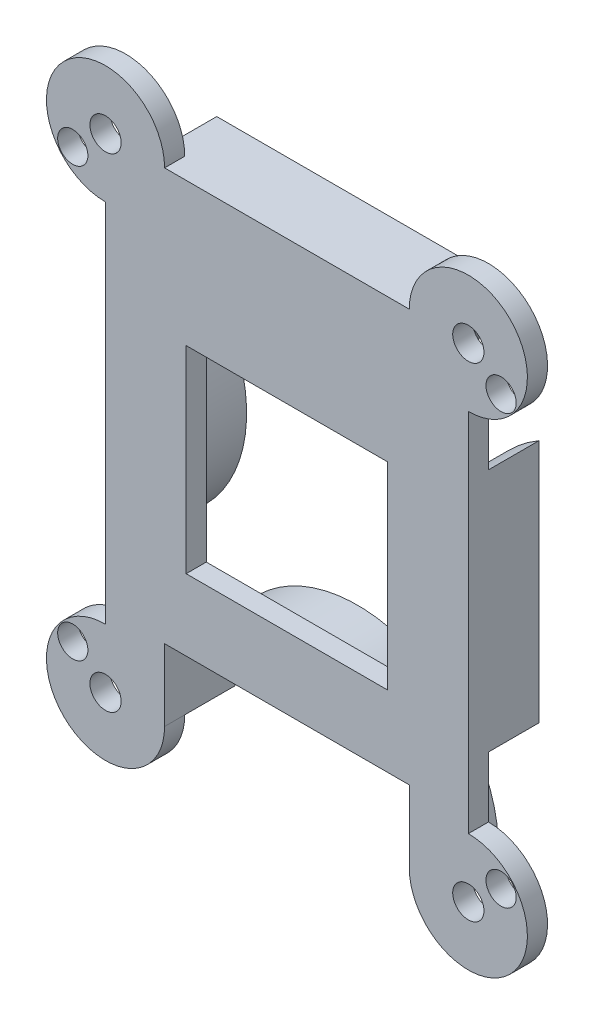
ISO-10303-21;
HEADER;
FILE_DESCRIPTION(('STEP AP214'),'2;1');
FILE_NAME('part.step','',(''),(''),'','','');
FILE_SCHEMA(('AUTOMOTIVE_DESIGN { 1 0 10303 214 1 1 1 1 }'));
ENDSEC;
DATA;
#1=APPLICATION_CONTEXT('core data for automotive mechanical design processes');
#2=APPLICATION_PROTOCOL_DEFINITION('international standard','automotive_design',2000,#1);
#3=PRODUCT_CONTEXT('',#1,'mechanical');
#4=PRODUCT('Part','Part','',(#3));
#5=PRODUCT_RELATED_PRODUCT_CATEGORY('part','',(#4));
#6=PRODUCT_DEFINITION_FORMATION('','',#4);
#7=PRODUCT_DEFINITION_CONTEXT('part definition',#1,'design');
#8=PRODUCT_DEFINITION('design','',#6,#7);
#9=PRODUCT_DEFINITION_SHAPE('','',#8);
#10=(LENGTH_UNIT() NAMED_UNIT(*) SI_UNIT(.MILLI.,.METRE.));
#11=(NAMED_UNIT(*) PLANE_ANGLE_UNIT() SI_UNIT($,.RADIAN.));
#12=(NAMED_UNIT(*) SI_UNIT($,.STERADIAN.) SOLID_ANGLE_UNIT());
#13=UNCERTAINTY_MEASURE_WITH_UNIT(LENGTH_MEASURE(1.E-05),#10,'distance_accuracy_value','');
#14=(GEOMETRIC_REPRESENTATION_CONTEXT(3) GLOBAL_UNCERTAINTY_ASSIGNED_CONTEXT((#13)) GLOBAL_UNIT_ASSIGNED_CONTEXT((#10,
#11,#12)) REPRESENTATION_CONTEXT('',''));
#15=CARTESIAN_POINT('',(0.,0.,0.));
#16=DIRECTION('',(0.,0.,1.));
#17=DIRECTION('',(1.,0.,0.));
#18=AXIS2_PLACEMENT_3D('',#15,#16,#17);
#19=CARTESIAN_POINT('',(0.,-24.,2.));
#20=DIRECTION('',(0.,1.,0.));
#21=DIRECTION('',(0.,0.,1.));
#22=AXIS2_PLACEMENT_3D('',#19,#20,#21);
#23=PLANE('',#22);
#24=DIRECTION('',(1.,0.,0.));
#25=VECTOR('',#24,1.);
#26=CARTESIAN_POINT('',(0.,-24.,-5.));
#27=LINE('',#26,#25);
#28=CARTESIAN_POINT('',(-13.9642400437689,-24.,-5.));
#29=VERTEX_POINT('',#28);
#30=CARTESIAN_POINT('',(-12.1394203950022,-24.,-5.));
#31=VERTEX_POINT('',#30);
#32=EDGE_CURVE('E369',#29,#31,#27,.T.);
#33=ORIENTED_EDGE('',*,*,#32,.T.);
#34=DIRECTION('',(0.,0.,1.));
#35=VECTOR('',#34,1.);
#36=CARTESIAN_POINT('',(-12.1394203950022,-24.,2.));
#37=LINE('',#36,#35);
#38=CARTESIAN_POINT('',(-12.1394203950022,-24.,0.));
#39=VERTEX_POINT('',#38);
#40=EDGE_CURVE('E310',#31,#39,#37,.T.);
#41=ORIENTED_EDGE('',*,*,#40,.T.);
#42=DIRECTION('',(1.,0.,0.));
#43=VECTOR('',#42,1.);
#44=CARTESIAN_POINT('',(0.,-24.,0.));
#45=LINE('',#44,#43);
#46=CARTESIAN_POINT('',(-13.9642400437689,-24.,0.));
#47=VERTEX_POINT('',#46);
#48=EDGE_CURVE('E378',#47,#39,#45,.T.);
#49=ORIENTED_EDGE('',*,*,#48,.F.);
#50=DIRECTION('',(0.,0.,1.));
#51=VECTOR('',#50,1.);
#52=CARTESIAN_POINT('',(-13.9642400437689,-24.,-5.));
#53=LINE('',#52,#51);
#54=EDGE_CURVE('E372',#29,#47,#53,.T.);
#55=ORIENTED_EDGE('',*,*,#54,.F.);
#56=EDGE_LOOP('',(#33,#41,#49,#55));
#57=FACE_BOUND('',#56,.T.);
#58=ADVANCED_FACE('F85',(#57),#23,.F.);
#59=CARTESIAN_POINT('',(0.,-25.,-5.));
#60=DIRECTION('',(0.,0.,1.));
#61=DIRECTION('',(1.,0.,0.));
#62=AXIS2_PLACEMENT_3D('',#59,#60,#61);
#63=CYLINDRICAL_SURFACE('',#62,14.);
#64=CARTESIAN_POINT('',(0.,-25.,0.));
#65=DIRECTION('',(0.,0.,1.));
#66=DIRECTION('',(1.,0.,0.));
#67=AXIS2_PLACEMENT_3D('',#64,#65,#66);
#68=CIRCLE('',#67,14.);
#69=CARTESIAN_POINT('',(-12.1394203950022,-18.0261579833348,0.));
#70=VERTEX_POINT('',#69);
#71=EDGE_CURVE('E373',#47,#70,#68,.F.);
#72=ORIENTED_EDGE('',*,*,#71,.T.);
#73=DIRECTION('',(0.,0.,1.));
#74=VECTOR('',#73,1.);
#75=CARTESIAN_POINT('',(-12.1394203950022,-18.0261579833348,-5.));
#76=LINE('',#75,#74);
#77=CARTESIAN_POINT('',(-12.1394203950022,-18.0261579833348,-5.));
#78=VERTEX_POINT('',#77);
#79=EDGE_CURVE('E307',#70,#78,#76,.F.);
#80=ORIENTED_EDGE('',*,*,#79,.T.);
#81=CARTESIAN_POINT('',(0.,-25.,-5.));
#82=DIRECTION('',(0.,0.,1.));
#83=DIRECTION('',(1.,0.,0.));
#84=AXIS2_PLACEMENT_3D('',#81,#82,#83);
#85=CIRCLE('',#84,14.);
#86=EDGE_CURVE('E363',#29,#78,#85,.F.);
#87=ORIENTED_EDGE('',*,*,#86,.F.);
#88=ORIENTED_EDGE('',*,*,#54,.T.);
#89=EDGE_LOOP('',(#72,#80,#87,#88));
#90=FACE_BOUND('',#89,.T.);
#91=ADVANCED_FACE('F579',(#90),#63,.T.);
#92=CARTESIAN_POINT('',(-11.405462124256,-16.8811679576332,-5.));
#93=VERTEX_POINT('',#92);
#94=CARTESIAN_POINT('',(11.405462124256,-16.8811679576332,-5.));
#95=VERTEX_POINT('',#94);
#96=EDGE_CURVE('E367',#93,#95,#85,.F.);
#97=ORIENTED_EDGE('',*,*,#96,.F.);
#98=DIRECTION('',(0.,0.,1.));
#99=VECTOR('',#98,1.);
#100=CARTESIAN_POINT('',(-11.405462124256,-16.8811679576332,-5.));
#101=LINE('',#100,#99);
#102=CARTESIAN_POINT('',(-11.405462124256,-16.8811679576332,0.));
#103=VERTEX_POINT('',#102);
#104=EDGE_CURVE('E301',#93,#103,#101,.T.);
#105=ORIENTED_EDGE('',*,*,#104,.T.);
#106=CARTESIAN_POINT('',(11.405462124256,-16.8811679576332,0.));
#107=VERTEX_POINT('',#106);
#108=EDGE_CURVE('E377',#103,#107,#68,.F.);
#109=ORIENTED_EDGE('',*,*,#108,.T.);
#110=DIRECTION('',(0.,0.,1.));
#111=VECTOR('',#110,1.);
#112=CARTESIAN_POINT('',(11.405462124256,-16.8811679576332,-5.));
#113=LINE('',#112,#111);
#114=EDGE_CURVE('E298',#107,#95,#113,.F.);
#115=ORIENTED_EDGE('',*,*,#114,.T.);
#116=EDGE_LOOP('',(#97,#105,#109,#115));
#117=FACE_BOUND('',#116,.T.);
#118=ADVANCED_FACE('F523',(#117),#63,.T.);
#119=CARTESIAN_POINT('',(0.,0.,-5.));
#120=DIRECTION('',(0.,0.,1.));
#121=DIRECTION('',(1.,0.,0.));
#122=AXIS2_PLACEMENT_3D('',#119,#120,#121);
#123=PLANE('',#122);
#124=ORIENTED_EDGE('',*,*,#86,.T.);
#125=DIRECTION('',(0.,-1.,0.));
#126=VECTOR('',#125,1.);
#127=CARTESIAN_POINT('',(-12.1394203950022,0.,-5.));
#128=LINE('',#127,#126);
#129=EDGE_CURVE('E12',#78,#31,#128,.T.);
#130=ORIENTED_EDGE('',*,*,#129,.T.);
#131=ORIENTED_EDGE('',*,*,#32,.F.);
#132=EDGE_LOOP('',(#124,#130,#131));
#133=FACE_BOUND('',#132,.T.);
#134=ADVANCED_FACE('F582',(#133),#123,.F.);
#135=ORIENTED_EDGE('',*,*,#96,.T.);
#136=DIRECTION('',(-1.,0.,0.));
#137=VECTOR('',#136,1.);
#138=CARTESIAN_POINT('',(0.,-16.8811679576332,-5.));
#139=LINE('',#138,#137);
#140=EDGE_CURVE('E93',#95,#93,#139,.T.);
#141=ORIENTED_EDGE('',*,*,#140,.T.);
#142=EDGE_LOOP('',(#135,#141));
#143=FACE_BOUND('',#142,.T.);
#144=ADVANCED_FACE('F521',(#143),#123,.F.);
#145=CARTESIAN_POINT('',(0.,0.,0.));
#146=DIRECTION('',(0.,0.,1.));
#147=DIRECTION('',(1.,0.,0.));
#148=AXIS2_PLACEMENT_3D('',#145,#146,#147);
#149=PLANE('',#148);
#150=CARTESIAN_POINT('',(21.25,-21.2500000000002,0.));
#151=DIRECTION('',(0.,0.,1.));
#152=DIRECTION('',(1.,0.,0.));
#153=AXIS2_PLACEMENT_3D('',#150,#151,#152);
#154=CIRCLE('',#153,1.49999999999997);
#155=CARTESIAN_POINT('',(22.75,-21.2500000000002,0.));
#156=VERTEX_POINT('',#155);
#157=EDGE_CURVE('E329',#156,#156,#154,.T.);
#158=ORIENTED_EDGE('',*,*,#157,.T.);
#159=EDGE_LOOP('',(#158));
#160=FACE_BOUND('',#159,.T.);
#161=CARTESIAN_POINT('',(21.25,21.2500000000002,0.));
#162=DIRECTION('',(0.,0.,1.));
#163=DIRECTION('',(1.,0.,0.));
#164=AXIS2_PLACEMENT_3D('',#161,#162,#163);
#165=CIRCLE('',#164,1.49999999999997);
#166=CARTESIAN_POINT('',(22.75,21.2500000000002,0.));
#167=VERTEX_POINT('',#166);
#168=EDGE_CURVE('E325',#167,#167,#165,.T.);
#169=ORIENTED_EDGE('',*,*,#168,.T.);
#170=EDGE_LOOP('',(#169));
#171=FACE_BOUND('',#170,.T.);
#172=CARTESIAN_POINT('',(-21.25,21.2500000000002,0.));
#173=DIRECTION('',(0.,0.,1.));
#174=DIRECTION('',(1.,0.,0.));
#175=AXIS2_PLACEMENT_3D('',#172,#173,#174);
#176=CIRCLE('',#175,1.49999999999997);
#177=CARTESIAN_POINT('',(-19.75,21.2500000000002,0.));
#178=VERTEX_POINT('',#177);
#179=EDGE_CURVE('E321',#178,#178,#176,.T.);
#180=ORIENTED_EDGE('',*,*,#179,.T.);
#181=EDGE_LOOP('',(#180));
#182=FACE_BOUND('',#181,.T.);
#183=CARTESIAN_POINT('',(-21.25,-21.2500000000002,0.));
#184=DIRECTION('',(0.,0.,1.));
#185=DIRECTION('',(1.,0.,0.));
#186=AXIS2_PLACEMENT_3D('',#183,#184,#185);
#187=CIRCLE('',#186,1.49999999999997);
#188=CARTESIAN_POINT('',(-19.75,-21.2500000000002,0.));
#189=VERTEX_POINT('',#188);
#190=EDGE_CURVE('E317',#189,#189,#187,.T.);
#191=ORIENTED_EDGE('',*,*,#190,.T.);
#192=EDGE_LOOP('',(#191));
#193=FACE_BOUND('',#192,.T.);
#194=DIRECTION('',(1.,0.,0.));
#195=VECTOR('',#194,1.);
#196=CARTESIAN_POINT('',(10.,9.80220497297068,0.));
#197=LINE('',#196,#195);
#198=CARTESIAN_POINT('',(-10.,9.80220497297068,0.));
#199=VERTEX_POINT('',#198);
#200=CARTESIAN_POINT('',(10.,9.80220497297068,0.));
#201=VERTEX_POINT('',#200);
#202=EDGE_CURVE('E347',#199,#201,#197,.T.);
#203=ORIENTED_EDGE('',*,*,#202,.F.);
#204=DIRECTION('',(0.,1.,0.));
#205=VECTOR('',#204,1.);
#206=CARTESIAN_POINT('',(-10.,9.80220497297068,0.));
#207=LINE('',#206,#205);
#208=CARTESIAN_POINT('',(-10.,-9.80220497297069,0.));
#209=VERTEX_POINT('',#208);
#210=EDGE_CURVE('E108',#209,#199,#207,.T.);
#211=ORIENTED_EDGE('',*,*,#210,.F.);
#212=DIRECTION('',(-1.,0.,0.));
#213=VECTOR('',#212,1.);
#214=CARTESIAN_POINT('',(10.,-9.80220497297069,0.));
#215=LINE('',#214,#213);
#216=CARTESIAN_POINT('',(10.,-9.80220497297069,0.));
#217=VERTEX_POINT('',#216);
#218=EDGE_CURVE('E336',#217,#209,#215,.T.);
#219=ORIENTED_EDGE('',*,*,#218,.F.);
#220=DIRECTION('',(0.,-1.,0.));
#221=VECTOR('',#220,1.);
#222=CARTESIAN_POINT('',(10.,9.80220497297068,0.));
#223=LINE('',#222,#221);
#224=EDGE_CURVE('E350',#201,#217,#223,.T.);
#225=ORIENTED_EDGE('',*,*,#224,.F.);
#226=EDGE_LOOP('',(#203,#211,#219,#225));
#227=FACE_BOUND('',#226,.T.);
#228=CARTESIAN_POINT('',(-18.,-24.,0.));
#229=DIRECTION('',(0.,0.,1.));
#230=DIRECTION('',(1.,0.,0.));
#231=AXIS2_PLACEMENT_3D('',#228,#229,#230);
#232=CIRCLE('',#231,1.55);
#233=CARTESIAN_POINT('',(-16.45,-24.,0.));
#234=VERTEX_POINT('',#233);
#235=EDGE_CURVE('E418',#234,#234,#232,.F.);
#236=ORIENTED_EDGE('',*,*,#235,.F.);
#237=EDGE_LOOP('',(#236));
#238=FACE_BOUND('',#237,.T.);
#239=CARTESIAN_POINT('',(-18.,24.,0.));
#240=DIRECTION('',(0.,0.,1.));
#241=DIRECTION('',(1.,0.,0.));
#242=AXIS2_PLACEMENT_3D('',#239,#240,#241);
#243=CIRCLE('',#242,1.55);
#244=CARTESIAN_POINT('',(-16.45,24.,0.));
#245=VERTEX_POINT('',#244);
#246=EDGE_CURVE('E469',#245,#245,#243,.T.);
#247=ORIENTED_EDGE('',*,*,#246,.T.);
#248=EDGE_LOOP('',(#247));
#249=FACE_BOUND('',#248,.T.);
#250=CARTESIAN_POINT('',(18.,-24.,0.));
#251=DIRECTION('',(0.,0.,1.));
#252=DIRECTION('',(1.,0.,0.));
#253=AXIS2_PLACEMENT_3D('',#250,#251,#252);
#254=CIRCLE('',#253,1.55);
#255=CARTESIAN_POINT('',(19.55,-24.,0.));
#256=VERTEX_POINT('',#255);
#257=EDGE_CURVE('E466',#256,#256,#254,.T.);
#258=ORIENTED_EDGE('',*,*,#257,.T.);
#259=EDGE_LOOP('',(#258));
#260=FACE_BOUND('',#259,.T.);
#261=CARTESIAN_POINT('',(18.,24.,0.));
#262=DIRECTION('',(0.,0.,1.));
#263=DIRECTION('',(1.,0.,0.));
#264=AXIS2_PLACEMENT_3D('',#261,#262,#263);
#265=CIRCLE('',#264,1.55);
#266=CARTESIAN_POINT('',(19.55,24.,0.));
#267=VERTEX_POINT('',#266);
#268=EDGE_CURVE('E463',#267,#267,#265,.F.);
#269=ORIENTED_EDGE('',*,*,#268,.F.);
#270=EDGE_LOOP('',(#269));
#271=FACE_BOUND('',#270,.T.);
#272=DIRECTION('',(-1.,0.,0.));
#273=VECTOR('',#272,1.);
#274=CARTESIAN_POINT('',(0.,-16.8811679576332,0.));
#275=LINE('',#274,#273);
#276=CARTESIAN_POINT('',(-12.1394203950022,-16.8811679576332,0.));
#277=VERTEX_POINT('',#276);
#278=EDGE_CURVE('E304',#103,#277,#275,.T.);
#279=ORIENTED_EDGE('',*,*,#278,.T.);
#280=DIRECTION('',(0.,-1.,0.));
#281=VECTOR('',#280,1.);
#282=CARTESIAN_POINT('',(-12.1394203950022,0.,0.));
#283=LINE('',#282,#281);
#284=EDGE_CURVE('E313',#277,#70,#283,.T.);
#285=ORIENTED_EDGE('',*,*,#284,.T.);
#286=ORIENTED_EDGE('',*,*,#71,.F.);
#287=ORIENTED_EDGE('',*,*,#48,.T.);
#288=CARTESIAN_POINT('',(-18.,-24.,0.));
#289=DIRECTION('',(0.,0.,1.));
#290=DIRECTION('',(1.,0.,0.));
#291=AXIS2_PLACEMENT_3D('',#288,#289,#290);
#292=CIRCLE('',#291,5.86057960499778);
#293=CARTESIAN_POINT('',(-18.,-18.1394203950022,0.));
#294=VERTEX_POINT('',#293);
#295=EDGE_CURVE('E457',#39,#294,#292,.F.);
#296=ORIENTED_EDGE('',*,*,#295,.T.);
#297=DIRECTION('',(0.,-1.,0.));
#298=VECTOR('',#297,1.);
#299=CARTESIAN_POINT('',(-18.,0.,0.));
#300=LINE('',#299,#298);
#301=CARTESIAN_POINT('',(-18.,-12.1243556529821,0.));
#302=VERTEX_POINT('',#301);
#303=EDGE_CURVE('E453',#302,#294,#300,.T.);
#304=ORIENTED_EDGE('',*,*,#303,.F.);
#305=CARTESIAN_POINT('',(-25.,0.,0.));
#306=DIRECTION('',(0.,0.,1.));
#307=DIRECTION('',(1.,0.,0.));
#308=AXIS2_PLACEMENT_3D('',#305,#306,#307);
#309=CIRCLE('',#308,14.);
#310=CARTESIAN_POINT('',(-18.,12.1243556529821,0.));
#311=VERTEX_POINT('',#310);
#312=EDGE_CURVE('E384',#302,#311,#309,.T.);
#313=ORIENTED_EDGE('',*,*,#312,.T.);
#314=CARTESIAN_POINT('',(-18.,18.1394203950022,0.));
#315=VERTEX_POINT('',#314);
#316=EDGE_CURVE('E454',#315,#311,#300,.T.);
#317=ORIENTED_EDGE('',*,*,#316,.F.);
#318=CARTESIAN_POINT('',(-18.,24.,0.));
#319=DIRECTION('',(0.,0.,1.));
#320=DIRECTION('',(1.,0.,0.));
#321=AXIS2_PLACEMENT_3D('',#318,#319,#320);
#322=CIRCLE('',#321,5.86057960499779);
#323=CARTESIAN_POINT('',(-12.1394203950022,24.,0.));
#324=VERTEX_POINT('',#323);
#325=EDGE_CURVE('E451',#324,#315,#322,.T.);
#326=ORIENTED_EDGE('',*,*,#325,.F.);
#327=DIRECTION('',(1.,0.,0.));
#328=VECTOR('',#327,1.);
#329=CARTESIAN_POINT('',(0.,24.,0.));
#330=LINE('',#329,#328);
#331=CARTESIAN_POINT('',(-13.9642400437689,24.,0.));
#332=VERTEX_POINT('',#331);
#333=EDGE_CURVE('E501',#332,#324,#330,.T.);
#334=ORIENTED_EDGE('',*,*,#333,.F.);
#335=CARTESIAN_POINT('',(0.,25.,0.));
#336=DIRECTION('',(0.,0.,1.));
#337=DIRECTION('',(1.,0.,0.));
#338=AXIS2_PLACEMENT_3D('',#335,#336,#337);
#339=CIRCLE('',#338,14.);
#340=CARTESIAN_POINT('',(13.9642400437689,24.,0.));
#341=VERTEX_POINT('',#340);
#342=EDGE_CURVE('E497',#332,#341,#339,.T.);
#343=ORIENTED_EDGE('',*,*,#342,.T.);
#344=CARTESIAN_POINT('',(12.1394203950022,24.,0.));
#345=VERTEX_POINT('',#344);
#346=EDGE_CURVE('E493',#345,#341,#330,.T.);
#347=ORIENTED_EDGE('',*,*,#346,.F.);
#348=CARTESIAN_POINT('',(18.,24.,0.));
#349=DIRECTION('',(0.,0.,1.));
#350=DIRECTION('',(1.,0.,0.));
#351=AXIS2_PLACEMENT_3D('',#348,#349,#350);
#352=CIRCLE('',#351,5.86057960499778);
#353=CARTESIAN_POINT('',(18.,18.1394203950022,0.));
#354=VERTEX_POINT('',#353);
#355=EDGE_CURVE('E448',#345,#354,#352,.F.);
#356=ORIENTED_EDGE('',*,*,#355,.T.);
#357=DIRECTION('',(0.,-1.,0.));
#358=VECTOR('',#357,1.);
#359=CARTESIAN_POINT('',(18.,0.,0.));
#360=LINE('',#359,#358);
#361=CARTESIAN_POINT('',(18.,12.1243556529821,0.));
#362=VERTEX_POINT('',#361);
#363=EDGE_CURVE('E446',#354,#362,#360,.T.);
#364=ORIENTED_EDGE('',*,*,#363,.T.);
#365=CARTESIAN_POINT('',(25.,0.,0.));
#366=DIRECTION('',(0.,0.,1.));
#367=DIRECTION('',(1.,0.,0.));
#368=AXIS2_PLACEMENT_3D('',#365,#366,#367);
#369=CIRCLE('',#368,14.);
#370=CARTESIAN_POINT('',(18.,-12.1243556529821,0.));
#371=VERTEX_POINT('',#370);
#372=EDGE_CURVE('E397',#371,#362,#369,.F.);
#373=ORIENTED_EDGE('',*,*,#372,.F.);
#374=CARTESIAN_POINT('',(18.,-18.1394203950022,0.));
#375=VERTEX_POINT('',#374);
#376=EDGE_CURVE('E411',#371,#375,#360,.T.);
#377=ORIENTED_EDGE('',*,*,#376,.T.);
#378=CARTESIAN_POINT('',(18.,-24.,0.));
#379=DIRECTION('',(0.,0.,1.));
#380=DIRECTION('',(1.,0.,0.));
#381=AXIS2_PLACEMENT_3D('',#378,#379,#380);
#382=CIRCLE('',#381,5.86057960499779);
#383=CARTESIAN_POINT('',(12.1394203950022,-24.,0.));
#384=VERTEX_POINT('',#383);
#385=EDGE_CURVE('E460',#384,#375,#382,.T.);
#386=ORIENTED_EDGE('',*,*,#385,.F.);
#387=CARTESIAN_POINT('',(13.9642400437689,-24.,0.));
#388=VERTEX_POINT('',#387);
#389=EDGE_CURVE('E376',#384,#388,#45,.T.);
#390=ORIENTED_EDGE('',*,*,#389,.T.);
#391=CARTESIAN_POINT('',(12.1394203950022,-18.0261579833348,0.));
#392=VERTEX_POINT('',#391);
#393=EDGE_CURVE('E357',#392,#388,#68,.F.);
#394=ORIENTED_EDGE('',*,*,#393,.F.);
#395=DIRECTION('',(0.,1.,0.));
#396=VECTOR('',#395,1.);
#397=CARTESIAN_POINT('',(12.1394203950022,0.,0.));
#398=LINE('',#397,#396);
#399=CARTESIAN_POINT('',(12.1394203950022,-16.8811679576332,0.));
#400=VERTEX_POINT('',#399);
#401=EDGE_CURVE('E296',#392,#400,#398,.T.);
#402=ORIENTED_EDGE('',*,*,#401,.T.);
#403=EDGE_CURVE('E272',#400,#107,#275,.T.);
#404=ORIENTED_EDGE('',*,*,#403,.T.);
#405=ORIENTED_EDGE('',*,*,#108,.F.);
#406=EDGE_LOOP('',(#279,#285,#286,#287,#296,#304,#313,#317,#326,#334,#343,#347,#356,#364,#373,
#377,#386,#390,#394,#402,#404,#405));
#407=FACE_BOUND('',#406,.T.);
#408=ADVANCED_FACE('F541',(#160,#171,#182,#193,#227,#238,#249,#260,#271,#407),#149,.F.);
#409=CARTESIAN_POINT('',(0.,24.,-5.));
#410=DIRECTION('',(0.,-1.,0.));
#411=DIRECTION('',(0.,0.,-1.));
#412=AXIS2_PLACEMENT_3D('',#409,#410,#411);
#413=PLANE('',#412);
#414=ORIENTED_EDGE('',*,*,#333,.T.);
#415=DIRECTION('',(0.,0.,-1.));
#416=VECTOR('',#415,1.);
#417=CARTESIAN_POINT('',(-12.1394203950022,24.,2.));
#418=LINE('',#417,#416);
#419=CARTESIAN_POINT('',(-12.1394203950022,24.,2.));
#420=VERTEX_POINT('',#419);
#421=EDGE_CURVE('E485',#420,#324,#418,.T.);
#422=ORIENTED_EDGE('',*,*,#421,.F.);
#423=DIRECTION('',(1.,0.,0.));
#424=VECTOR('',#423,1.);
#425=CARTESIAN_POINT('',(0.,24.,2.));
#426=LINE('',#425,#424);
#427=CARTESIAN_POINT('',(12.1394203950022,24.,2.));
#428=VERTEX_POINT('',#427);
#429=EDGE_CURVE('E421',#420,#428,#426,.T.);
#430=ORIENTED_EDGE('',*,*,#429,.T.);
#431=DIRECTION('',(0.,0.,-1.));
#432=VECTOR('',#431,1.);
#433=CARTESIAN_POINT('',(12.1394203950022,24.,2.));
#434=LINE('',#433,#432);
#435=EDGE_CURVE('E488',#428,#345,#434,.T.);
#436=ORIENTED_EDGE('',*,*,#435,.T.);
#437=ORIENTED_EDGE('',*,*,#346,.T.);
#438=DIRECTION('',(0.,0.,1.));
#439=VECTOR('',#438,1.);
#440=CARTESIAN_POINT('',(13.9642400437689,24.,-5.));
#441=LINE('',#440,#439);
#442=CARTESIAN_POINT('',(13.9642400437689,24.,-5.));
#443=VERTEX_POINT('',#442);
#444=EDGE_CURVE('E505',#443,#341,#441,.T.);
#445=ORIENTED_EDGE('',*,*,#444,.F.);
#446=DIRECTION('',(1.,0.,0.));
#447=VECTOR('',#446,1.);
#448=CARTESIAN_POINT('',(0.,24.,-5.));
#449=LINE('',#448,#447);
#450=CARTESIAN_POINT('',(-13.9642400437689,24.,-5.));
#451=VERTEX_POINT('',#450);
#452=EDGE_CURVE('E494',#451,#443,#449,.T.);
#453=ORIENTED_EDGE('',*,*,#452,.F.);
#454=DIRECTION('',(0.,0.,1.));
#455=VECTOR('',#454,1.);
#456=CARTESIAN_POINT('',(-13.9642400437689,24.,-5.));
#457=LINE('',#456,#455);
#458=EDGE_CURVE('E500',#451,#332,#457,.T.);
#459=ORIENTED_EDGE('',*,*,#458,.T.);
#460=EDGE_LOOP('',(#414,#422,#430,#436,#437,#445,#453,#459));
#461=FACE_BOUND('',#460,.T.);
#462=ADVANCED_FACE('F87',(#461),#413,.F.);
#463=CARTESIAN_POINT('',(0.,25.,-5.));
#464=DIRECTION('',(0.,0.,1.));
#465=DIRECTION('',(1.,0.,0.));
#466=AXIS2_PLACEMENT_3D('',#463,#464,#465);
#467=CYLINDRICAL_SURFACE('',#466,14.);
#468=ORIENTED_EDGE('',*,*,#342,.F.);
#469=ORIENTED_EDGE('',*,*,#458,.F.);
#470=CARTESIAN_POINT('',(0.,25.,-5.));
#471=DIRECTION('',(0.,0.,1.));
#472=DIRECTION('',(1.,0.,0.));
#473=AXIS2_PLACEMENT_3D('',#470,#471,#472);
#474=CIRCLE('',#473,14.);
#475=EDGE_CURVE('E496',#451,#443,#474,.T.);
#476=ORIENTED_EDGE('',*,*,#475,.T.);
#477=ORIENTED_EDGE('',*,*,#444,.T.);
#478=EDGE_LOOP('',(#468,#469,#476,#477));
#479=FACE_BOUND('',#478,.T.);
#480=ADVANCED_FACE('F623',(#479),#467,.T.);
#481=CARTESIAN_POINT('',(0.,0.,-5.));
#482=DIRECTION('',(0.,0.,1.));
#483=DIRECTION('',(1.,0.,0.));
#484=AXIS2_PLACEMENT_3D('',#481,#482,#483);
#485=PLANE('',#484);
#486=ORIENTED_EDGE('',*,*,#452,.T.);
#487=ORIENTED_EDGE('',*,*,#475,.F.);
#488=EDGE_LOOP('',(#486,#487));
#489=FACE_BOUND('',#488,.T.);
#490=ADVANCED_FACE('F621',(#489),#485,.F.);
#491=CARTESIAN_POINT('',(18.,0.,2.));
#492=DIRECTION('',(1.,0.,0.));
#493=DIRECTION('',(0.,1.,0.));
#494=AXIS2_PLACEMENT_3D('',#491,#492,#493);
#495=PLANE('',#494);
#496=ORIENTED_EDGE('',*,*,#363,.F.);
#497=DIRECTION('',(0.,0.,-1.));
#498=VECTOR('',#497,1.);
#499=CARTESIAN_POINT('',(18.,18.1394203950022,2.));
#500=LINE('',#499,#498);
#501=CARTESIAN_POINT('',(18.,18.1394203950022,2.));
#502=VERTEX_POINT('',#501);
#503=EDGE_CURVE('E491',#502,#354,#500,.T.);
#504=ORIENTED_EDGE('',*,*,#503,.F.);
#505=DIRECTION('',(0.,-1.,0.));
#506=VECTOR('',#505,1.);
#507=CARTESIAN_POINT('',(18.,0.,2.));
#508=LINE('',#507,#506);
#509=CARTESIAN_POINT('',(18.,-18.1394203950022,2.));
#510=VERTEX_POINT('',#509);
#511=EDGE_CURVE('E414',#502,#510,#508,.T.);
#512=ORIENTED_EDGE('',*,*,#511,.T.);
#513=DIRECTION('',(0.,0.,-1.));
#514=VECTOR('',#513,1.);
#515=CARTESIAN_POINT('',(18.,-18.1394203950022,2.));
#516=LINE('',#515,#514);
#517=EDGE_CURVE('E445',#510,#375,#516,.T.);
#518=ORIENTED_EDGE('',*,*,#517,.T.);
#519=ORIENTED_EDGE('',*,*,#376,.F.);
#520=DIRECTION('',(0.,0.,1.));
#521=VECTOR('',#520,1.);
#522=CARTESIAN_POINT('',(18.,-12.1243556529821,-5.));
#523=LINE('',#522,#521);
#524=CARTESIAN_POINT('',(18.,-12.1243556529821,-5.));
#525=VERTEX_POINT('',#524);
#526=EDGE_CURVE('E405',#525,#371,#523,.T.);
#527=ORIENTED_EDGE('',*,*,#526,.F.);
#528=DIRECTION('',(0.,-1.,0.));
#529=VECTOR('',#528,1.);
#530=CARTESIAN_POINT('',(18.,0.,-5.));
#531=LINE('',#530,#529);
#532=CARTESIAN_POINT('',(18.,12.1243556529821,-5.));
#533=VERTEX_POINT('',#532);
#534=EDGE_CURVE('E403',#533,#525,#531,.T.);
#535=ORIENTED_EDGE('',*,*,#534,.F.);
#536=DIRECTION('',(0.,0.,1.));
#537=VECTOR('',#536,1.);
#538=CARTESIAN_POINT('',(18.,12.1243556529821,-5.));
#539=LINE('',#538,#537);
#540=EDGE_CURVE('E408',#533,#362,#539,.T.);
#541=ORIENTED_EDGE('',*,*,#540,.T.);
#542=EDGE_LOOP('',(#496,#504,#512,#518,#519,#527,#535,#541));
#543=FACE_BOUND('',#542,.T.);
#544=ADVANCED_FACE('F618',(#543),#495,.T.);
#545=CARTESIAN_POINT('',(18.,24.,2.));
#546=DIRECTION('',(0.,0.,-1.));
#547=DIRECTION('',(-1.,0.,0.));
#548=AXIS2_PLACEMENT_3D('',#545,#546,#547);
#549=CYLINDRICAL_SURFACE('',#548,5.86057960499778);
#550=ORIENTED_EDGE('',*,*,#355,.F.);
#551=ORIENTED_EDGE('',*,*,#435,.F.);
#552=CARTESIAN_POINT('',(18.,24.,2.));
#553=DIRECTION('',(0.,0.,1.));
#554=DIRECTION('',(1.,0.,0.));
#555=AXIS2_PLACEMENT_3D('',#552,#553,#554);
#556=CIRCLE('',#555,5.86057960499778);
#557=EDGE_CURVE('E417',#428,#502,#556,.F.);
#558=ORIENTED_EDGE('',*,*,#557,.T.);
#559=ORIENTED_EDGE('',*,*,#503,.T.);
#560=EDGE_LOOP('',(#550,#551,#558,#559));
#561=FACE_BOUND('',#560,.T.);
#562=ADVANCED_FACE('F552',(#561),#549,.T.);
#563=CARTESIAN_POINT('',(-18.,24.,2.));
#564=DIRECTION('',(0.,0.,-1.));
#565=DIRECTION('',(-1.,0.,0.));
#566=AXIS2_PLACEMENT_3D('',#563,#564,#565);
#567=CYLINDRICAL_SURFACE('',#566,5.86057960499779);
#568=ORIENTED_EDGE('',*,*,#325,.T.);
#569=DIRECTION('',(0.,0.,-1.));
#570=VECTOR('',#569,1.);
#571=CARTESIAN_POINT('',(-18.,18.1394203950022,2.));
#572=LINE('',#571,#570);
#573=CARTESIAN_POINT('',(-18.,18.1394203950022,2.));
#574=VERTEX_POINT('',#573);
#575=EDGE_CURVE('E482',#574,#315,#572,.T.);
#576=ORIENTED_EDGE('',*,*,#575,.F.);
#577=CARTESIAN_POINT('',(-18.,24.,2.));
#578=DIRECTION('',(0.,0.,1.));
#579=DIRECTION('',(1.,0.,0.));
#580=AXIS2_PLACEMENT_3D('',#577,#578,#579);
#581=CIRCLE('',#580,5.86057960499779);
#582=EDGE_CURVE('E424',#420,#574,#581,.T.);
#583=ORIENTED_EDGE('',*,*,#582,.F.);
#584=ORIENTED_EDGE('',*,*,#421,.T.);
#585=EDGE_LOOP('',(#568,#576,#583,#584));
#586=FACE_BOUND('',#585,.T.);
#587=ADVANCED_FACE('F562',(#586),#567,.T.);
#588=CARTESIAN_POINT('',(-18.,0.,2.));
#589=DIRECTION('',(1.,0.,0.));
#590=DIRECTION('',(0.,1.,0.));
#591=AXIS2_PLACEMENT_3D('',#588,#589,#590);
#592=PLANE('',#591);
#593=ORIENTED_EDGE('',*,*,#316,.T.);
#594=DIRECTION('',(0.,0.,1.));
#595=VECTOR('',#594,1.);
#596=CARTESIAN_POINT('',(-18.,12.1243556529821,-5.));
#597=LINE('',#596,#595);
#598=CARTESIAN_POINT('',(-18.,12.1243556529821,-5.));
#599=VERTEX_POINT('',#598);
#600=EDGE_CURVE('E395',#599,#311,#597,.T.);
#601=ORIENTED_EDGE('',*,*,#600,.F.);
#602=DIRECTION('',(0.,-1.,0.));
#603=VECTOR('',#602,1.);
#604=CARTESIAN_POINT('',(-18.,0.,-5.));
#605=LINE('',#604,#603);
#606=CARTESIAN_POINT('',(-18.,-12.1243556529821,-5.));
#607=VERTEX_POINT('',#606);
#608=EDGE_CURVE('E386',#599,#607,#605,.T.);
#609=ORIENTED_EDGE('',*,*,#608,.T.);
#610=DIRECTION('',(0.,0.,1.));
#611=VECTOR('',#610,1.);
#612=CARTESIAN_POINT('',(-18.,-12.1243556529821,-5.));
#613=LINE('',#612,#611);
#614=EDGE_CURVE('E392',#607,#302,#613,.T.);
#615=ORIENTED_EDGE('',*,*,#614,.T.);
#616=ORIENTED_EDGE('',*,*,#303,.T.);
#617=DIRECTION('',(0.,0.,-1.));
#618=VECTOR('',#617,1.);
#619=CARTESIAN_POINT('',(-18.,-18.1394203950022,2.));
#620=LINE('',#619,#618);
#621=CARTESIAN_POINT('',(-18.,-18.1394203950022,2.));
#622=VERTEX_POINT('',#621);
#623=EDGE_CURVE('E479',#622,#294,#620,.T.);
#624=ORIENTED_EDGE('',*,*,#623,.F.);
#625=DIRECTION('',(0.,-1.,0.));
#626=VECTOR('',#625,1.);
#627=CARTESIAN_POINT('',(-18.,0.,2.));
#628=LINE('',#627,#626);
#629=EDGE_CURVE('E426',#574,#622,#628,.T.);
#630=ORIENTED_EDGE('',*,*,#629,.F.);
#631=ORIENTED_EDGE('',*,*,#575,.T.);
#632=EDGE_LOOP('',(#593,#601,#609,#615,#616,#624,#630,#631));
#633=FACE_BOUND('',#632,.T.);
#634=ADVANCED_FACE('F566',(#633),#592,.F.);
#635=CARTESIAN_POINT('',(-18.,-24.,2.));
#636=DIRECTION('',(0.,0.,-1.));
#637=DIRECTION('',(-1.,0.,0.));
#638=AXIS2_PLACEMENT_3D('',#635,#636,#637);
#639=CYLINDRICAL_SURFACE('',#638,5.86057960499778);
#640=ORIENTED_EDGE('',*,*,#295,.F.);
#641=DIRECTION('',(0.,0.,-1.));
#642=VECTOR('',#641,1.);
#643=CARTESIAN_POINT('',(-12.1394203950022,-24.,2.));
#644=LINE('',#643,#642);
#645=CARTESIAN_POINT('',(-12.1394203950022,-24.,2.));
#646=VERTEX_POINT('',#645);
#647=EDGE_CURVE('E477',#646,#39,#644,.T.);
#648=ORIENTED_EDGE('',*,*,#647,.F.);
#649=CARTESIAN_POINT('',(-18.,-24.,2.));
#650=DIRECTION('',(0.,0.,1.));
#651=DIRECTION('',(1.,0.,0.));
#652=AXIS2_PLACEMENT_3D('',#649,#650,#651);
#653=CIRCLE('',#652,5.86057960499778);
#654=EDGE_CURVE('E428',#646,#622,#653,.F.);
#655=ORIENTED_EDGE('',*,*,#654,.T.);
#656=ORIENTED_EDGE('',*,*,#623,.T.);
#657=EDGE_LOOP('',(#640,#648,#655,#656));
#658=FACE_BOUND('',#657,.T.);
#659=ADVANCED_FACE('F571',(#658),#639,.T.);
#660=ORIENTED_EDGE('',*,*,#389,.F.);
#661=DIRECTION('',(0.,0.,-1.));
#662=VECTOR('',#661,1.);
#663=CARTESIAN_POINT('',(12.1394203950022,-24.,2.));
#664=LINE('',#663,#662);
#665=CARTESIAN_POINT('',(12.1394203950022,-24.,-5.));
#666=VERTEX_POINT('',#665);
#667=EDGE_CURVE('E293',#384,#666,#664,.T.);
#668=ORIENTED_EDGE('',*,*,#667,.T.);
#669=CARTESIAN_POINT('',(13.9642400437689,-24.,-5.));
#670=VERTEX_POINT('',#669);
#671=EDGE_CURVE('E366',#666,#670,#27,.T.);
#672=ORIENTED_EDGE('',*,*,#671,.T.);
#673=DIRECTION('',(0.,0.,1.));
#674=VECTOR('',#673,1.);
#675=CARTESIAN_POINT('',(13.9642400437689,-24.,-5.));
#676=LINE('',#675,#674);
#677=EDGE_CURVE('E381',#670,#388,#676,.T.);
#678=ORIENTED_EDGE('',*,*,#677,.T.);
#679=EDGE_LOOP('',(#660,#668,#672,#678));
#680=FACE_BOUND('',#679,.T.);
#681=ADVANCED_FACE('F538',(#680),#23,.F.);
#682=CARTESIAN_POINT('',(-18.,24.,2.));
#683=DIRECTION('',(0.,0.,-1.));
#684=DIRECTION('',(-1.,0.,0.));
#685=AXIS2_PLACEMENT_3D('',#682,#683,#684);
#686=CYLINDRICAL_SURFACE('',#685,1.55);
#687=CARTESIAN_POINT('',(-18.,24.,2.));
#688=DIRECTION('',(0.,0.,1.));
#689=DIRECTION('',(1.,0.,0.));
#690=AXIS2_PLACEMENT_3D('',#687,#688,#689);
#691=CIRCLE('',#690,1.55);
#692=CARTESIAN_POINT('',(-16.45,24.,2.));
#693=VERTEX_POINT('',#692);
#694=EDGE_CURVE('E439',#693,#693,#691,.T.);
#695=ORIENTED_EDGE('',*,*,#694,.T.);
#696=EDGE_LOOP('',(#695));
#697=FACE_BOUND('',#696,.T.);
#698=ORIENTED_EDGE('',*,*,#246,.F.);
#699=EDGE_LOOP('',(#698));
#700=FACE_BOUND('',#699,.T.);
#701=ADVANCED_FACE('F601',(#697,#700),#686,.F.);
#702=CARTESIAN_POINT('',(18.,-24.,2.));
#703=DIRECTION('',(0.,0.,-1.));
#704=DIRECTION('',(-1.,0.,0.));
#705=AXIS2_PLACEMENT_3D('',#702,#703,#704);
#706=CYLINDRICAL_SURFACE('',#705,1.55);
#707=CARTESIAN_POINT('',(18.,-24.,2.));
#708=DIRECTION('',(0.,0.,1.));
#709=DIRECTION('',(1.,0.,0.));
#710=AXIS2_PLACEMENT_3D('',#707,#708,#709);
#711=CIRCLE('',#710,1.55);
#712=CARTESIAN_POINT('',(19.55,-24.,2.));
#713=VERTEX_POINT('',#712);
#714=EDGE_CURVE('E436',#713,#713,#711,.T.);
#715=ORIENTED_EDGE('',*,*,#714,.T.);
#716=EDGE_LOOP('',(#715));
#717=FACE_BOUND('',#716,.T.);
#718=ORIENTED_EDGE('',*,*,#257,.F.);
#719=EDGE_LOOP('',(#718));
#720=FACE_BOUND('',#719,.T.);
#721=ADVANCED_FACE('F606',(#717,#720),#706,.F.);
#722=CARTESIAN_POINT('',(18.,24.,2.));
#723=DIRECTION('',(0.,0.,-1.));
#724=DIRECTION('',(-1.,0.,0.));
#725=AXIS2_PLACEMENT_3D('',#722,#723,#724);
#726=CYLINDRICAL_SURFACE('',#725,1.55);
#727=CARTESIAN_POINT('',(18.,24.,2.));
#728=DIRECTION('',(0.,0.,1.));
#729=DIRECTION('',(1.,0.,0.));
#730=AXIS2_PLACEMENT_3D('',#727,#728,#729);
#731=CIRCLE('',#730,1.55);
#732=CARTESIAN_POINT('',(19.55,24.,2.));
#733=VERTEX_POINT('',#732);
#734=EDGE_CURVE('E433',#733,#733,#731,.F.);
#735=ORIENTED_EDGE('',*,*,#734,.F.);
#736=EDGE_LOOP('',(#735));
#737=FACE_BOUND('',#736,.T.);
#738=ORIENTED_EDGE('',*,*,#268,.T.);
#739=EDGE_LOOP('',(#738));
#740=FACE_BOUND('',#739,.T.);
#741=ADVANCED_FACE('F666',(#737,#740),#726,.F.);
#742=CARTESIAN_POINT('',(18.,-24.,2.));
#743=DIRECTION('',(0.,0.,-1.));
#744=DIRECTION('',(-1.,0.,0.));
#745=AXIS2_PLACEMENT_3D('',#742,#743,#744);
#746=CYLINDRICAL_SURFACE('',#745,5.86057960499779);
#747=ORIENTED_EDGE('',*,*,#385,.T.);
#748=ORIENTED_EDGE('',*,*,#517,.F.);
#749=CARTESIAN_POINT('',(18.,-24.,2.));
#750=DIRECTION('',(0.,0.,1.));
#751=DIRECTION('',(1.,0.,0.));
#752=AXIS2_PLACEMENT_3D('',#749,#750,#751);
#753=CIRCLE('',#752,5.86057960499779);
#754=CARTESIAN_POINT('',(12.1394203950022,-24.,2.));
#755=VERTEX_POINT('',#754);
#756=EDGE_CURVE('E431',#755,#510,#753,.T.);
#757=ORIENTED_EDGE('',*,*,#756,.F.);
#758=DIRECTION('',(0.,0.,-1.));
#759=VECTOR('',#758,1.);
#760=CARTESIAN_POINT('',(12.1394203950022,-24.,2.));
#761=LINE('',#760,#759);
#762=EDGE_CURVE('E280',#755,#384,#761,.T.);
#763=ORIENTED_EDGE('',*,*,#762,.T.);
#764=EDGE_LOOP('',(#747,#748,#757,#763));
#765=FACE_BOUND('',#764,.T.);
#766=ADVANCED_FACE('F545',(#765),#746,.T.);
#767=CARTESIAN_POINT('',(-18.,-24.,2.));
#768=DIRECTION('',(0.,0.,-1.));
#769=DIRECTION('',(-1.,0.,0.));
#770=AXIS2_PLACEMENT_3D('',#767,#768,#769);
#771=CYLINDRICAL_SURFACE('',#770,1.55);
#772=CARTESIAN_POINT('',(-18.,-24.,2.));
#773=DIRECTION('',(0.,0.,1.));
#774=DIRECTION('',(1.,0.,0.));
#775=AXIS2_PLACEMENT_3D('',#772,#773,#774);
#776=CIRCLE('',#775,1.55);
#777=CARTESIAN_POINT('',(-16.45,-24.,2.));
#778=VERTEX_POINT('',#777);
#779=EDGE_CURVE('E442',#778,#778,#776,.F.);
#780=ORIENTED_EDGE('',*,*,#779,.F.);
#781=EDGE_LOOP('',(#780));
#782=FACE_BOUND('',#781,.T.);
#783=ORIENTED_EDGE('',*,*,#235,.T.);
#784=EDGE_LOOP('',(#783));
#785=FACE_BOUND('',#784,.T.);
#786=ADVANCED_FACE('F657',(#782,#785),#771,.F.);
#787=CARTESIAN_POINT('',(0.,0.,2.));
#788=DIRECTION('',(0.,0.,1.));
#789=DIRECTION('',(1.,0.,0.));
#790=AXIS2_PLACEMENT_3D('',#787,#788,#789);
#791=PLANE('',#790);
#792=DIRECTION('',(0.,-1.,0.));
#793=VECTOR('',#792,1.);
#794=CARTESIAN_POINT('',(-12.1394203950022,-16.8811679576332,2.));
#795=LINE('',#794,#793);
#796=CARTESIAN_POINT('',(-12.1394203950022,-16.8811679576332,2.));
#797=VERTEX_POINT('',#796);
#798=EDGE_CURVE('E283',#797,#646,#795,.T.);
#799=ORIENTED_EDGE('',*,*,#798,.F.);
#800=DIRECTION('',(-1.,0.,0.));
#801=VECTOR('',#800,1.);
#802=CARTESIAN_POINT('',(12.1394203950022,-16.8811679576332,2.));
#803=LINE('',#802,#801);
#804=CARTESIAN_POINT('',(12.1394203950022,-16.8811679576332,2.));
#805=VERTEX_POINT('',#804);
#806=EDGE_CURVE('E269',#805,#797,#803,.T.);
#807=ORIENTED_EDGE('',*,*,#806,.F.);
#808=DIRECTION('',(0.,1.,0.));
#809=VECTOR('',#808,1.);
#810=CARTESIAN_POINT('',(12.1394203950022,-16.8811679576332,2.));
#811=LINE('',#810,#809);
#812=EDGE_CURVE('E277',#755,#805,#811,.T.);
#813=ORIENTED_EDGE('',*,*,#812,.F.);
#814=ORIENTED_EDGE('',*,*,#756,.T.);
#815=ORIENTED_EDGE('',*,*,#511,.F.);
#816=ORIENTED_EDGE('',*,*,#557,.F.);
#817=ORIENTED_EDGE('',*,*,#429,.F.);
#818=ORIENTED_EDGE('',*,*,#582,.T.);
#819=ORIENTED_EDGE('',*,*,#629,.T.);
#820=ORIENTED_EDGE('',*,*,#654,.F.);
#821=EDGE_LOOP('',(#799,#807,#813,#814,#815,#816,#817,#818,#819,#820));
#822=FACE_BOUND('',#821,.T.);
#823=CARTESIAN_POINT('',(21.25,-21.2500000000002,2.));
#824=DIRECTION('',(0.,0.,1.));
#825=DIRECTION('',(1.,0.,0.));
#826=AXIS2_PLACEMENT_3D('',#823,#824,#825);
#827=CIRCLE('',#826,1.49999999999997);
#828=CARTESIAN_POINT('',(22.75,-21.2500000000002,2.));
#829=VERTEX_POINT('',#828);
#830=EDGE_CURVE('E328',#829,#829,#827,.T.);
#831=ORIENTED_EDGE('',*,*,#830,.F.);
#832=EDGE_LOOP('',(#831));
#833=FACE_BOUND('',#832,.T.);
#834=CARTESIAN_POINT('',(21.25,21.2500000000002,2.));
#835=DIRECTION('',(0.,0.,1.));
#836=DIRECTION('',(1.,0.,0.));
#837=AXIS2_PLACEMENT_3D('',#834,#835,#836);
#838=CIRCLE('',#837,1.49999999999997);
#839=CARTESIAN_POINT('',(22.75,21.2500000000002,2.));
#840=VERTEX_POINT('',#839);
#841=EDGE_CURVE('E324',#840,#840,#838,.T.);
#842=ORIENTED_EDGE('',*,*,#841,.F.);
#843=EDGE_LOOP('',(#842));
#844=FACE_BOUND('',#843,.T.);
#845=CARTESIAN_POINT('',(-21.25,21.2500000000002,2.));
#846=DIRECTION('',(0.,0.,1.));
#847=DIRECTION('',(1.,0.,0.));
#848=AXIS2_PLACEMENT_3D('',#845,#846,#847);
#849=CIRCLE('',#848,1.49999999999997);
#850=CARTESIAN_POINT('',(-19.75,21.2500000000002,2.));
#851=VERTEX_POINT('',#850);
#852=EDGE_CURVE('E320',#851,#851,#849,.T.);
#853=ORIENTED_EDGE('',*,*,#852,.F.);
#854=EDGE_LOOP('',(#853));
#855=FACE_BOUND('',#854,.T.);
#856=CARTESIAN_POINT('',(-21.25,-21.2500000000002,2.));
#857=DIRECTION('',(0.,0.,1.));
#858=DIRECTION('',(1.,0.,0.));
#859=AXIS2_PLACEMENT_3D('',#856,#857,#858);
#860=CIRCLE('',#859,1.49999999999997);
#861=CARTESIAN_POINT('',(-19.75,-21.2500000000002,2.));
#862=VERTEX_POINT('',#861);
#863=EDGE_CURVE('E316',#862,#862,#860,.T.);
#864=ORIENTED_EDGE('',*,*,#863,.F.);
#865=EDGE_LOOP('',(#864));
#866=FACE_BOUND('',#865,.T.);
#867=DIRECTION('',(0.,1.,0.));
#868=VECTOR('',#867,1.);
#869=CARTESIAN_POINT('',(-10.,9.80220497297068,2.));
#870=LINE('',#869,#868);
#871=CARTESIAN_POINT('',(-10.,-9.80220497297069,2.));
#872=VERTEX_POINT('',#871);
#873=CARTESIAN_POINT('',(-10.,9.80220497297068,2.));
#874=VERTEX_POINT('',#873);
#875=EDGE_CURVE('E332',#872,#874,#870,.T.);
#876=ORIENTED_EDGE('',*,*,#875,.T.);
#877=DIRECTION('',(1.,0.,0.));
#878=VECTOR('',#877,1.);
#879=CARTESIAN_POINT('',(10.,9.80220497297068,2.));
#880=LINE('',#879,#878);
#881=CARTESIAN_POINT('',(10.,9.80220497297068,2.));
#882=VERTEX_POINT('',#881);
#883=EDGE_CURVE('E335',#874,#882,#880,.T.);
#884=ORIENTED_EDGE('',*,*,#883,.T.);
#885=DIRECTION('',(0.,-1.,0.));
#886=VECTOR('',#885,1.);
#887=CARTESIAN_POINT('',(10.,9.80220497297068,2.));
#888=LINE('',#887,#886);
#889=CARTESIAN_POINT('',(10.,-9.80220497297069,2.));
#890=VERTEX_POINT('',#889);
#891=EDGE_CURVE('E339',#882,#890,#888,.T.);
#892=ORIENTED_EDGE('',*,*,#891,.T.);
#893=DIRECTION('',(-1.,0.,0.));
#894=VECTOR('',#893,1.);
#895=CARTESIAN_POINT('',(10.,-9.80220497297069,2.));
#896=LINE('',#895,#894);
#897=EDGE_CURVE('E342',#890,#872,#896,.T.);
#898=ORIENTED_EDGE('',*,*,#897,.T.);
#899=EDGE_LOOP('',(#876,#884,#892,#898));
#900=FACE_BOUND('',#899,.T.);
#901=ORIENTED_EDGE('',*,*,#734,.T.);
#902=EDGE_LOOP('',(#901));
#903=FACE_BOUND('',#902,.T.);
#904=ORIENTED_EDGE('',*,*,#714,.F.);
#905=EDGE_LOOP('',(#904));
#906=FACE_BOUND('',#905,.T.);
#907=ORIENTED_EDGE('',*,*,#694,.F.);
#908=EDGE_LOOP('',(#907));
#909=FACE_BOUND('',#908,.T.);
#910=ORIENTED_EDGE('',*,*,#779,.T.);
#911=EDGE_LOOP('',(#910));
#912=FACE_BOUND('',#911,.T.);
#913=ADVANCED_FACE('F285',(#822,#833,#844,#855,#866,#900,#903,#906,#909,#912),#791,.T.);
#914=CARTESIAN_POINT('',(25.,0.,-5.));
#915=DIRECTION('',(0.,0.,1.));
#916=DIRECTION('',(1.,0.,0.));
#917=AXIS2_PLACEMENT_3D('',#914,#915,#916);
#918=CYLINDRICAL_SURFACE('',#917,14.);
#919=ORIENTED_EDGE('',*,*,#372,.T.);
#920=ORIENTED_EDGE('',*,*,#540,.F.);
#921=CARTESIAN_POINT('',(25.,0.,-5.));
#922=DIRECTION('',(0.,0.,1.));
#923=DIRECTION('',(1.,0.,0.));
#924=AXIS2_PLACEMENT_3D('',#921,#922,#923);
#925=CIRCLE('',#924,14.);
#926=EDGE_CURVE('E400',#525,#533,#925,.F.);
#927=ORIENTED_EDGE('',*,*,#926,.F.);
#928=ORIENTED_EDGE('',*,*,#526,.T.);
#929=EDGE_LOOP('',(#919,#920,#927,#928));
#930=FACE_BOUND('',#929,.T.);
#931=ADVANCED_FACE('F648',(#930),#918,.T.);
#932=CARTESIAN_POINT('',(0.,0.,-5.));
#933=DIRECTION('',(0.,0.,1.));
#934=DIRECTION('',(1.,0.,0.));
#935=AXIS2_PLACEMENT_3D('',#932,#933,#934);
#936=PLANE('',#935);
#937=ORIENTED_EDGE('',*,*,#926,.T.);
#938=ORIENTED_EDGE('',*,*,#534,.T.);
#939=EDGE_LOOP('',(#937,#938));
#940=FACE_BOUND('',#939,.T.);
#941=ADVANCED_FACE('F641',(#940),#936,.F.);
#942=CARTESIAN_POINT('',(-25.,0.,-5.));
#943=DIRECTION('',(0.,0.,1.));
#944=DIRECTION('',(1.,0.,0.));
#945=AXIS2_PLACEMENT_3D('',#942,#943,#944);
#946=CYLINDRICAL_SURFACE('',#945,14.);
#947=ORIENTED_EDGE('',*,*,#312,.F.);
#948=ORIENTED_EDGE('',*,*,#614,.F.);
#949=CARTESIAN_POINT('',(-25.,0.,-5.));
#950=DIRECTION('',(0.,0.,1.));
#951=DIRECTION('',(1.,0.,0.));
#952=AXIS2_PLACEMENT_3D('',#949,#950,#951);
#953=CIRCLE('',#952,14.);
#954=EDGE_CURVE('E389',#607,#599,#953,.T.);
#955=ORIENTED_EDGE('',*,*,#954,.T.);
#956=ORIENTED_EDGE('',*,*,#600,.T.);
#957=EDGE_LOOP('',(#947,#948,#955,#956));
#958=FACE_BOUND('',#957,.T.);
#959=ADVANCED_FACE('F639',(#958),#946,.T.);
#960=CARTESIAN_POINT('',(0.,0.,-5.));
#961=DIRECTION('',(0.,0.,1.));
#962=DIRECTION('',(1.,0.,0.));
#963=AXIS2_PLACEMENT_3D('',#960,#961,#962);
#964=PLANE('',#963);
#965=ORIENTED_EDGE('',*,*,#608,.F.);
#966=ORIENTED_EDGE('',*,*,#954,.F.);
#967=EDGE_LOOP('',(#965,#966));
#968=FACE_BOUND('',#967,.T.);
#969=ADVANCED_FACE('F638',(#968),#964,.F.);
#970=CARTESIAN_POINT('',(12.1394203950022,-18.0261579833348,-5.));
#971=VERTEX_POINT('',#970);
#972=EDGE_CURVE('E368',#971,#670,#85,.F.);
#973=ORIENTED_EDGE('',*,*,#972,.F.);
#974=DIRECTION('',(0.,0.,1.));
#975=VECTOR('',#974,1.);
#976=CARTESIAN_POINT('',(12.1394203950022,-18.0261579833348,-5.));
#977=LINE('',#976,#975);
#978=EDGE_CURVE('E100',#971,#392,#977,.T.);
#979=ORIENTED_EDGE('',*,*,#978,.T.);
#980=ORIENTED_EDGE('',*,*,#393,.T.);
#981=ORIENTED_EDGE('',*,*,#677,.F.);
#982=EDGE_LOOP('',(#973,#979,#980,#981));
#983=FACE_BOUND('',#982,.T.);
#984=ADVANCED_FACE('F533',(#983),#63,.T.);
#985=ORIENTED_EDGE('',*,*,#671,.F.);
#986=DIRECTION('',(0.,1.,0.));
#987=VECTOR('',#986,1.);
#988=CARTESIAN_POINT('',(12.1394203950022,0.,-5.));
#989=LINE('',#988,#987);
#990=EDGE_CURVE('E507',#666,#971,#989,.T.);
#991=ORIENTED_EDGE('',*,*,#990,.T.);
#992=ORIENTED_EDGE('',*,*,#972,.T.);
#993=EDGE_LOOP('',(#985,#991,#992));
#994=FACE_BOUND('',#993,.T.);
#995=ADVANCED_FACE('F531',(#994),#123,.F.);
#996=CARTESIAN_POINT('',(-10.,9.80220497297068,2.));
#997=DIRECTION('',(-1.,0.,0.));
#998=DIRECTION('',(0.,-1.,0.));
#999=AXIS2_PLACEMENT_3D('',#996,#997,#998);
#1000=PLANE('',#999);
#1001=ORIENTED_EDGE('',*,*,#210,.T.);
#1002=DIRECTION('',(0.,0.,-1.));
#1003=VECTOR('',#1002,1.);
#1004=CARTESIAN_POINT('',(-10.,9.80220497297068,2.));
#1005=LINE('',#1004,#1003);
#1006=EDGE_CURVE('E345',#874,#199,#1005,.T.);
#1007=ORIENTED_EDGE('',*,*,#1006,.F.);
#1008=ORIENTED_EDGE('',*,*,#875,.F.);
#1009=DIRECTION('',(0.,0.,-1.));
#1010=VECTOR('',#1009,1.);
#1011=CARTESIAN_POINT('',(-10.,-9.80220497297069,2.));
#1012=LINE('',#1011,#1010);
#1013=EDGE_CURVE('E355',#872,#209,#1012,.T.);
#1014=ORIENTED_EDGE('',*,*,#1013,.T.);
#1015=EDGE_LOOP('',(#1001,#1007,#1008,#1014));
#1016=FACE_BOUND('',#1015,.T.);
#1017=ADVANCED_FACE('F592',(#1016),#1000,.F.);
#1018=CARTESIAN_POINT('',(10.,-9.80220497297069,2.));
#1019=DIRECTION('',(0.,-1.,0.));
#1020=DIRECTION('',(0.,0.,-1.));
#1021=AXIS2_PLACEMENT_3D('',#1018,#1019,#1020);
#1022=PLANE('',#1021);
#1023=ORIENTED_EDGE('',*,*,#218,.T.);
#1024=ORIENTED_EDGE('',*,*,#1013,.F.);
#1025=ORIENTED_EDGE('',*,*,#897,.F.);
#1026=DIRECTION('',(0.,0.,-1.));
#1027=VECTOR('',#1026,1.);
#1028=CARTESIAN_POINT('',(10.,-9.80220497297069,2.));
#1029=LINE('',#1028,#1027);
#1030=EDGE_CURVE('E358',#890,#217,#1029,.T.);
#1031=ORIENTED_EDGE('',*,*,#1030,.T.);
#1032=EDGE_LOOP('',(#1023,#1024,#1025,#1031));
#1033=FACE_BOUND('',#1032,.T.);
#1034=ADVANCED_FACE('F714',(#1033),#1022,.F.);
#1035=CARTESIAN_POINT('',(10.,9.80220497297068,2.));
#1036=DIRECTION('',(1.,0.,0.));
#1037=DIRECTION('',(0.,1.,0.));
#1038=AXIS2_PLACEMENT_3D('',#1035,#1036,#1037);
#1039=PLANE('',#1038);
#1040=ORIENTED_EDGE('',*,*,#224,.T.);
#1041=ORIENTED_EDGE('',*,*,#1030,.F.);
#1042=ORIENTED_EDGE('',*,*,#891,.F.);
#1043=DIRECTION('',(0.,0.,-1.));
#1044=VECTOR('',#1043,1.);
#1045=CARTESIAN_POINT('',(10.,9.80220497297068,2.));
#1046=LINE('',#1045,#1044);
#1047=EDGE_CURVE('E360',#882,#201,#1046,.T.);
#1048=ORIENTED_EDGE('',*,*,#1047,.T.);
#1049=EDGE_LOOP('',(#1040,#1041,#1042,#1048));
#1050=FACE_BOUND('',#1049,.T.);
#1051=ADVANCED_FACE('F722',(#1050),#1039,.F.);
#1052=CARTESIAN_POINT('',(10.,9.80220497297068,2.));
#1053=DIRECTION('',(0.,1.,0.));
#1054=DIRECTION('',(0.,0.,1.));
#1055=AXIS2_PLACEMENT_3D('',#1052,#1053,#1054);
#1056=PLANE('',#1055);
#1057=ORIENTED_EDGE('',*,*,#202,.T.);
#1058=ORIENTED_EDGE('',*,*,#1047,.F.);
#1059=ORIENTED_EDGE('',*,*,#883,.F.);
#1060=ORIENTED_EDGE('',*,*,#1006,.T.);
#1061=EDGE_LOOP('',(#1057,#1058,#1059,#1060));
#1062=FACE_BOUND('',#1061,.T.);
#1063=ADVANCED_FACE('F732',(#1062),#1056,.F.);
#1064=CARTESIAN_POINT('',(-21.25,-21.2500000000002,7.));
#1065=DIRECTION('',(0.,0.,-1.));
#1066=DIRECTION('',(-1.,0.,0.));
#1067=AXIS2_PLACEMENT_3D('',#1064,#1065,#1066);
#1068=CYLINDRICAL_SURFACE('',#1067,1.49999999999997);
#1069=ORIENTED_EDGE('',*,*,#863,.T.);
#1070=EDGE_LOOP('',(#1069));
#1071=FACE_BOUND('',#1070,.T.);
#1072=ORIENTED_EDGE('',*,*,#190,.F.);
#1073=EDGE_LOOP('',(#1072));
#1074=FACE_BOUND('',#1073,.T.);
#1075=ADVANCED_FACE('F742',(#1071,#1074),#1068,.F.);
#1076=CARTESIAN_POINT('',(-21.25,21.2500000000002,7.));
#1077=DIRECTION('',(0.,0.,-1.));
#1078=DIRECTION('',(-1.,0.,0.));
#1079=AXIS2_PLACEMENT_3D('',#1076,#1077,#1078);
#1080=CYLINDRICAL_SURFACE('',#1079,1.49999999999997);
#1081=ORIENTED_EDGE('',*,*,#852,.T.);
#1082=EDGE_LOOP('',(#1081));
#1083=FACE_BOUND('',#1082,.T.);
#1084=ORIENTED_EDGE('',*,*,#179,.F.);
#1085=EDGE_LOOP('',(#1084));
#1086=FACE_BOUND('',#1085,.T.);
#1087=ADVANCED_FACE('F752',(#1083,#1086),#1080,.F.);
#1088=CARTESIAN_POINT('',(21.25,21.2500000000002,7.));
#1089=DIRECTION('',(0.,0.,-1.));
#1090=DIRECTION('',(-1.,0.,0.));
#1091=AXIS2_PLACEMENT_3D('',#1088,#1089,#1090);
#1092=CYLINDRICAL_SURFACE('',#1091,1.49999999999997);
#1093=ORIENTED_EDGE('',*,*,#841,.T.);
#1094=EDGE_LOOP('',(#1093));
#1095=FACE_BOUND('',#1094,.T.);
#1096=ORIENTED_EDGE('',*,*,#168,.F.);
#1097=EDGE_LOOP('',(#1096));
#1098=FACE_BOUND('',#1097,.T.);
#1099=ADVANCED_FACE('F762',(#1095,#1098),#1092,.F.);
#1100=CARTESIAN_POINT('',(21.25,-21.2500000000002,7.));
#1101=DIRECTION('',(0.,0.,-1.));
#1102=DIRECTION('',(-1.,0.,0.));
#1103=AXIS2_PLACEMENT_3D('',#1100,#1101,#1102);
#1104=CYLINDRICAL_SURFACE('',#1103,1.49999999999997);
#1105=ORIENTED_EDGE('',*,*,#830,.T.);
#1106=EDGE_LOOP('',(#1105));
#1107=FACE_BOUND('',#1106,.T.);
#1108=ORIENTED_EDGE('',*,*,#157,.F.);
#1109=EDGE_LOOP('',(#1108));
#1110=FACE_BOUND('',#1109,.T.);
#1111=ADVANCED_FACE('F772',(#1107,#1110),#1104,.F.);
#1112=CARTESIAN_POINT('',(-12.1394203950022,-16.8811679576332,-8.));
#1113=DIRECTION('',(-1.,0.,0.));
#1114=DIRECTION('',(0.,0.,1.));
#1115=AXIS2_PLACEMENT_3D('',#1112,#1113,#1114);
#1116=PLANE('',#1115);
#1117=DIRECTION('',(0.,0.,1.));
#1118=VECTOR('',#1117,1.);
#1119=CARTESIAN_POINT('',(-12.1394203950022,-16.8811679576332,-8.));
#1120=LINE('',#1119,#1118);
#1121=EDGE_CURVE('E274',#277,#797,#1120,.T.);
#1122=ORIENTED_EDGE('',*,*,#1121,.T.);
#1123=ORIENTED_EDGE('',*,*,#798,.T.);
#1124=ORIENTED_EDGE('',*,*,#647,.T.);
#1125=ORIENTED_EDGE('',*,*,#40,.F.);
#1126=ORIENTED_EDGE('',*,*,#129,.F.);
#1127=ORIENTED_EDGE('',*,*,#79,.F.);
#1128=ORIENTED_EDGE('',*,*,#284,.F.);
#1129=EDGE_LOOP('',(#1122,#1123,#1124,#1125,#1126,#1127,#1128));
#1130=FACE_BOUND('',#1129,.T.);
#1131=ADVANCED_FACE('F573',(#1130),#1116,.F.);
#1132=CARTESIAN_POINT('',(12.1394203950022,-16.8811679576332,-8.));
#1133=DIRECTION('',(0.,1.,0.));
#1134=DIRECTION('',(0.,0.,1.));
#1135=AXIS2_PLACEMENT_3D('',#1132,#1133,#1134);
#1136=PLANE('',#1135);
#1137=DIRECTION('',(0.,0.,1.));
#1138=VECTOR('',#1137,1.);
#1139=CARTESIAN_POINT('',(12.1394203950022,-16.8811679576332,-8.));
#1140=LINE('',#1139,#1138);
#1141=EDGE_CURVE('E264',#400,#805,#1140,.T.);
#1142=ORIENTED_EDGE('',*,*,#1141,.T.);
#1143=ORIENTED_EDGE('',*,*,#806,.T.);
#1144=ORIENTED_EDGE('',*,*,#1121,.F.);
#1145=ORIENTED_EDGE('',*,*,#278,.F.);
#1146=ORIENTED_EDGE('',*,*,#104,.F.);
#1147=ORIENTED_EDGE('',*,*,#140,.F.);
#1148=ORIENTED_EDGE('',*,*,#114,.F.);
#1149=ORIENTED_EDGE('',*,*,#403,.F.);
#1150=EDGE_LOOP('',(#1142,#1143,#1144,#1145,#1146,#1147,#1148,#1149));
#1151=FACE_BOUND('',#1150,.T.);
#1152=ADVANCED_FACE('F266',(#1151),#1136,.F.);
#1153=CARTESIAN_POINT('',(12.1394203950022,-16.8811679576332,-8.));
#1154=DIRECTION('',(1.,0.,0.));
#1155=DIRECTION('',(0.,0.,-1.));
#1156=AXIS2_PLACEMENT_3D('',#1153,#1154,#1155);
#1157=PLANE('',#1156);
#1158=ORIENTED_EDGE('',*,*,#978,.F.);
#1159=ORIENTED_EDGE('',*,*,#990,.F.);
#1160=ORIENTED_EDGE('',*,*,#667,.F.);
#1161=ORIENTED_EDGE('',*,*,#762,.F.);
#1162=ORIENTED_EDGE('',*,*,#812,.T.);
#1163=ORIENTED_EDGE('',*,*,#1141,.F.);
#1164=ORIENTED_EDGE('',*,*,#401,.F.);
#1165=EDGE_LOOP('',(#1158,#1159,#1160,#1161,#1162,#1163,#1164));
#1166=FACE_BOUND('',#1165,.T.);
#1167=ADVANCED_FACE('F278',(#1166),#1157,.F.);
#1168=CLOSED_SHELL('',(#58,#91,#118,#134,#144,#408,#462,#480,#490,#544,#562,#587,#634,#659,#681,
#701,#721,#741,#766,#786,#913,#931,#941,#959,#969,#984,#995,#1017,#1034,#1051,#1063,#1075,#1087,
#1099,#1111,#1131,#1152,#1167));
#1169=MANIFOLD_SOLID_BREP('B2',#1168);
#1170=ADVANCED_BREP_SHAPE_REPRESENTATION('',(#18,#1169),#14);
#1171=SHAPE_DEFINITION_REPRESENTATION(#9,#1170);
ENDSEC;
END-ISO-10303-21;
